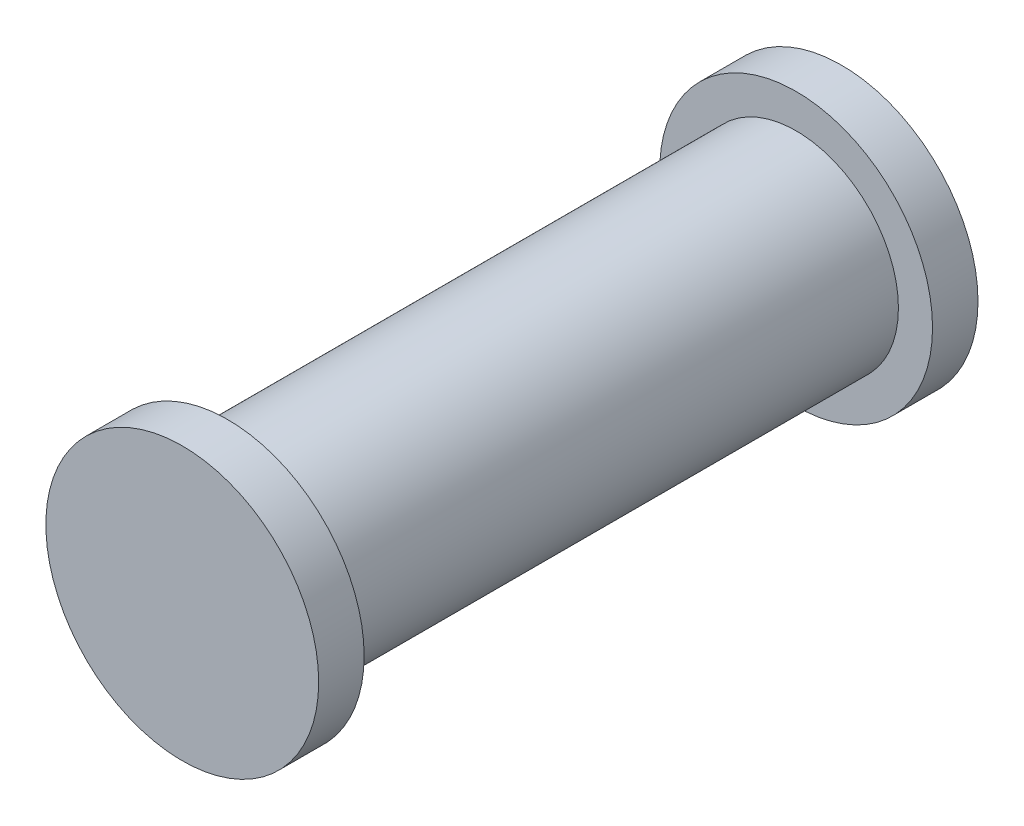
ISO-10303-21;
HEADER;
FILE_DESCRIPTION(('STEP AP214'),'2;1');
FILE_NAME('part.step','',(''),(''),'','','');
FILE_SCHEMA(('AUTOMOTIVE_DESIGN { 1 0 10303 214 1 1 1 1 }'));
ENDSEC;
DATA;
#1=APPLICATION_CONTEXT('core data for automotive mechanical design processes');
#2=APPLICATION_PROTOCOL_DEFINITION('international standard','automotive_design',2000,#1);
#3=PRODUCT_CONTEXT('',#1,'mechanical');
#4=PRODUCT('Part','Part','',(#3));
#5=PRODUCT_RELATED_PRODUCT_CATEGORY('part','',(#4));
#6=PRODUCT_DEFINITION_FORMATION('','',#4);
#7=PRODUCT_DEFINITION_CONTEXT('part definition',#1,'design');
#8=PRODUCT_DEFINITION('design','',#6,#7);
#9=PRODUCT_DEFINITION_SHAPE('','',#8);
#10=(LENGTH_UNIT() NAMED_UNIT(*) SI_UNIT(.MILLI.,.METRE.));
#11=(NAMED_UNIT(*) PLANE_ANGLE_UNIT() SI_UNIT($,.RADIAN.));
#12=(NAMED_UNIT(*) SI_UNIT($,.STERADIAN.) SOLID_ANGLE_UNIT());
#13=UNCERTAINTY_MEASURE_WITH_UNIT(LENGTH_MEASURE(1.E-05),#10,'distance_accuracy_value','');
#14=(GEOMETRIC_REPRESENTATION_CONTEXT(3) GLOBAL_UNCERTAINTY_ASSIGNED_CONTEXT((#13)) GLOBAL_UNIT_ASSIGNED_CONTEXT((#10,
#11,#12)) REPRESENTATION_CONTEXT('',''));
#15=CARTESIAN_POINT('',(0.,0.,0.));
#16=DIRECTION('',(0.,0.,1.));
#17=DIRECTION('',(1.,0.,0.));
#18=AXIS2_PLACEMENT_3D('',#15,#16,#17);
#19=CARTESIAN_POINT('',(0.,0.,25.));
#20=DIRECTION('',(0.,0.,-1.));
#21=DIRECTION('',(-1.,0.,0.));
#22=AXIS2_PLACEMENT_3D('',#19,#20,#21);
#23=CYLINDRICAL_SURFACE('',#22,4.5);
#24=CARTESIAN_POINT('',(0.,0.,25.));
#25=DIRECTION('',(0.,0.,1.));
#26=DIRECTION('',(1.,0.,0.));
#27=AXIS2_PLACEMENT_3D('',#24,#25,#26);
#28=CIRCLE('',#27,4.5);
#29=CARTESIAN_POINT('',(4.5,0.,25.));
#30=VERTEX_POINT('',#29);
#31=EDGE_CURVE('E10',#30,#30,#28,.T.);
#32=ORIENTED_EDGE('',*,*,#31,.F.);
#33=EDGE_LOOP('',(#32));
#34=FACE_BOUND('',#33,.T.);
#35=CARTESIAN_POINT('',(0.,0.,0.));
#36=DIRECTION('',(0.,0.,1.));
#37=DIRECTION('',(1.,0.,0.));
#38=AXIS2_PLACEMENT_3D('',#35,#36,#37);
#39=CIRCLE('',#38,4.5);
#40=CARTESIAN_POINT('',(4.5,0.,0.));
#41=VERTEX_POINT('',#40);
#42=EDGE_CURVE('E46',#41,#41,#39,.T.);
#43=ORIENTED_EDGE('',*,*,#42,.T.);
#44=EDGE_LOOP('',(#43));
#45=FACE_BOUND('',#44,.T.);
#46=ADVANCED_FACE('F43',(#34,#45),#23,.T.);
#47=CARTESIAN_POINT('',(0.,0.,-2.));
#48=DIRECTION('',(0.,0.,1.));
#49=DIRECTION('',(1.,0.,0.));
#50=AXIS2_PLACEMENT_3D('',#47,#48,#49);
#51=CYLINDRICAL_SURFACE('',#50,6.);
#52=CARTESIAN_POINT('',(0.,0.,-2.));
#53=DIRECTION('',(0.,0.,1.));
#54=DIRECTION('',(1.,0.,0.));
#55=AXIS2_PLACEMENT_3D('',#52,#53,#54);
#56=CIRCLE('',#55,6.);
#57=CARTESIAN_POINT('',(6.,0.,-2.));
#58=VERTEX_POINT('',#57);
#59=EDGE_CURVE('E55',#58,#58,#56,.T.);
#60=ORIENTED_EDGE('',*,*,#59,.T.);
#61=EDGE_LOOP('',(#60));
#62=FACE_BOUND('',#61,.T.);
#63=CARTESIAN_POINT('',(0.,0.,0.));
#64=DIRECTION('',(0.,0.,1.));
#65=DIRECTION('',(1.,0.,0.));
#66=AXIS2_PLACEMENT_3D('',#63,#64,#65);
#67=CIRCLE('',#66,6.);
#68=CARTESIAN_POINT('',(6.,0.,0.));
#69=VERTEX_POINT('',#68);
#70=EDGE_CURVE('E57',#69,#69,#67,.T.);
#71=ORIENTED_EDGE('',*,*,#70,.F.);
#72=EDGE_LOOP('',(#71));
#73=FACE_BOUND('',#72,.T.);
#74=ADVANCED_FACE('F90',(#62,#73),#51,.T.);
#75=CARTESIAN_POINT('',(0.,0.,-2.));
#76=DIRECTION('',(0.,0.,1.));
#77=DIRECTION('',(1.,0.,0.));
#78=AXIS2_PLACEMENT_3D('',#75,#76,#77);
#79=PLANE('',#78);
#80=ORIENTED_EDGE('',*,*,#59,.F.);
#81=EDGE_LOOP('',(#80));
#82=FACE_BOUND('',#81,.T.);
#83=ADVANCED_FACE('F95',(#82),#79,.F.);
#84=CARTESIAN_POINT('',(0.,0.,0.));
#85=DIRECTION('',(0.,0.,1.));
#86=DIRECTION('',(1.,0.,0.));
#87=AXIS2_PLACEMENT_3D('',#84,#85,#86);
#88=PLANE('',#87);
#89=ORIENTED_EDGE('',*,*,#42,.F.);
#90=EDGE_LOOP('',(#89));
#91=FACE_BOUND('',#90,.T.);
#92=ORIENTED_EDGE('',*,*,#70,.T.);
#93=EDGE_LOOP('',(#92));
#94=FACE_BOUND('',#93,.T.);
#95=ADVANCED_FACE('F78',(#91,#94),#88,.T.);
#96=CARTESIAN_POINT('',(0.,0.,27.));
#97=DIRECTION('',(0.,0.,-1.));
#98=DIRECTION('',(-1.,0.,0.));
#99=AXIS2_PLACEMENT_3D('',#96,#97,#98);
#100=CYLINDRICAL_SURFACE('',#99,6.);
#101=CARTESIAN_POINT('',(0.,0.,27.));
#102=DIRECTION('',(0.,0.,1.));
#103=DIRECTION('',(1.,0.,0.));
#104=AXIS2_PLACEMENT_3D('',#101,#102,#103);
#105=CIRCLE('',#104,6.);
#106=CARTESIAN_POINT('',(6.,0.,27.));
#107=VERTEX_POINT('',#106);
#108=EDGE_CURVE('E61',#107,#107,#105,.T.);
#109=ORIENTED_EDGE('',*,*,#108,.F.);
#110=EDGE_LOOP('',(#109));
#111=FACE_BOUND('',#110,.T.);
#112=CARTESIAN_POINT('',(0.,0.,25.));
#113=DIRECTION('',(0.,0.,1.));
#114=DIRECTION('',(1.,0.,0.));
#115=AXIS2_PLACEMENT_3D('',#112,#113,#114);
#116=CIRCLE('',#115,6.);
#117=CARTESIAN_POINT('',(6.,0.,25.));
#118=VERTEX_POINT('',#117);
#119=EDGE_CURVE('E65',#118,#118,#116,.T.);
#120=ORIENTED_EDGE('',*,*,#119,.T.);
#121=EDGE_LOOP('',(#120));
#122=FACE_BOUND('',#121,.T.);
#123=ADVANCED_FACE('F75',(#111,#122),#100,.T.);
#124=CARTESIAN_POINT('',(0.,0.,27.));
#125=DIRECTION('',(0.,0.,1.));
#126=DIRECTION('',(1.,0.,0.));
#127=AXIS2_PLACEMENT_3D('',#124,#125,#126);
#128=PLANE('',#127);
#129=ORIENTED_EDGE('',*,*,#108,.T.);
#130=EDGE_LOOP('',(#129));
#131=FACE_BOUND('',#130,.T.);
#132=ADVANCED_FACE('F73',(#131),#128,.T.);
#133=CARTESIAN_POINT('',(0.,0.,25.));
#134=DIRECTION('',(0.,0.,1.));
#135=DIRECTION('',(1.,0.,0.));
#136=AXIS2_PLACEMENT_3D('',#133,#134,#135);
#137=PLANE('',#136);
#138=ORIENTED_EDGE('',*,*,#31,.T.);
#139=EDGE_LOOP('',(#138));
#140=FACE_BOUND('',#139,.T.);
#141=ORIENTED_EDGE('',*,*,#119,.F.);
#142=EDGE_LOOP('',(#141));
#143=FACE_BOUND('',#142,.T.);
#144=ADVANCED_FACE('F82',(#140,#143),#137,.F.);
#145=CLOSED_SHELL('',(#46,#74,#83,#95,#123,#132,#144));
#146=MANIFOLD_SOLID_BREP('B2',#145);
#147=ADVANCED_BREP_SHAPE_REPRESENTATION('',(#18,#146),#14);
#148=SHAPE_DEFINITION_REPRESENTATION(#9,#147);
ENDSEC;
END-ISO-10303-21;
